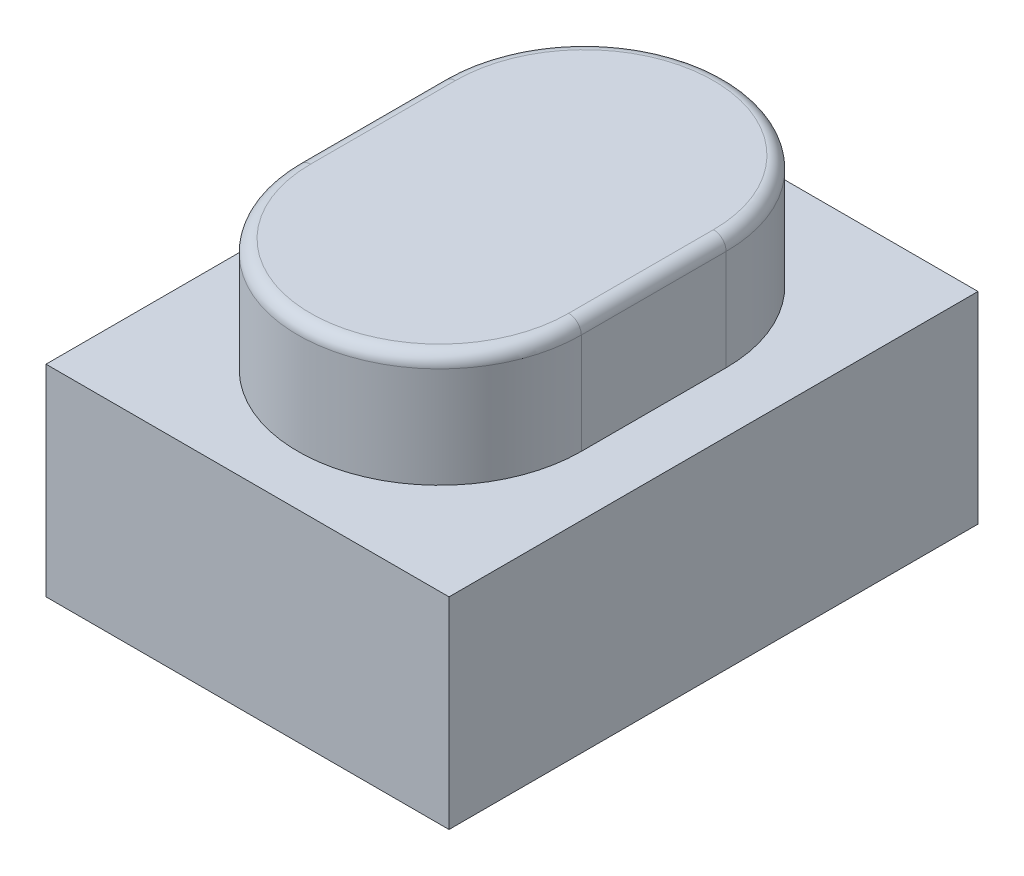
ISO-10303-21;
HEADER;
FILE_DESCRIPTION(('STEP AP214'),'2;1');
FILE_NAME('part.step','',(''),(''),'','','');
FILE_SCHEMA(('AUTOMOTIVE_DESIGN { 1 0 10303 214 1 1 1 1 }'));
ENDSEC;
DATA;
#1=APPLICATION_CONTEXT('core data for automotive mechanical design processes');
#2=APPLICATION_PROTOCOL_DEFINITION('international standard','automotive_design',2000,#1);
#3=PRODUCT_CONTEXT('',#1,'mechanical');
#4=PRODUCT('Part','Part','',(#3));
#5=PRODUCT_RELATED_PRODUCT_CATEGORY('part','',(#4));
#6=PRODUCT_DEFINITION_FORMATION('','',#4);
#7=PRODUCT_DEFINITION_CONTEXT('part definition',#1,'design');
#8=PRODUCT_DEFINITION('design','',#6,#7);
#9=PRODUCT_DEFINITION_SHAPE('','',#8);
#10=(LENGTH_UNIT() NAMED_UNIT(*) SI_UNIT(.MILLI.,.METRE.));
#11=(NAMED_UNIT(*) PLANE_ANGLE_UNIT() SI_UNIT($,.RADIAN.));
#12=(NAMED_UNIT(*) SI_UNIT($,.STERADIAN.) SOLID_ANGLE_UNIT());
#13=UNCERTAINTY_MEASURE_WITH_UNIT(LENGTH_MEASURE(1.E-05),#10,'distance_accuracy_value','');
#14=(GEOMETRIC_REPRESENTATION_CONTEXT(3) GLOBAL_UNCERTAINTY_ASSIGNED_CONTEXT((#13)) GLOBAL_UNIT_ASSIGNED_CONTEXT((#10,
#11,#12)) REPRESENTATION_CONTEXT('',''));
#15=CARTESIAN_POINT('',(0.,0.,0.));
#16=DIRECTION('',(0.,0.,1.));
#17=DIRECTION('',(1.,0.,0.));
#18=AXIS2_PLACEMENT_3D('',#15,#16,#17);
#19=CARTESIAN_POINT('',(1.6,1.6,-2.1));
#20=DIRECTION('',(-1.,0.,0.));
#21=DIRECTION('',(0.,0.,1.));
#22=AXIS2_PLACEMENT_3D('',#19,#20,#21);
#23=PLANE('',#22);
#24=DIRECTION('',(0.,0.,-1.));
#25=VECTOR('',#24,1.);
#26=CARTESIAN_POINT('',(1.6,0.,-2.1));
#27=LINE('',#26,#25);
#28=CARTESIAN_POINT('',(1.6,0.,2.1));
#29=VERTEX_POINT('',#28);
#30=CARTESIAN_POINT('',(1.6,0.,-2.1));
#31=VERTEX_POINT('',#30);
#32=EDGE_CURVE('E140',#29,#31,#27,.T.);
#33=ORIENTED_EDGE('',*,*,#32,.T.);
#34=DIRECTION('',(0.,-1.,0.));
#35=VECTOR('',#34,1.);
#36=CARTESIAN_POINT('',(1.6,1.6,-2.1));
#37=LINE('',#36,#35);
#38=CARTESIAN_POINT('',(1.6,1.6,-2.1));
#39=VERTEX_POINT('',#38);
#40=EDGE_CURVE('E167',#39,#31,#37,.T.);
#41=ORIENTED_EDGE('',*,*,#40,.F.);
#42=DIRECTION('',(0.,0.,-1.));
#43=VECTOR('',#42,1.);
#44=CARTESIAN_POINT('',(1.6,1.6,-2.1));
#45=LINE('',#44,#43);
#46=CARTESIAN_POINT('',(1.6,1.6,2.1));
#47=VERTEX_POINT('',#46);
#48=EDGE_CURVE('E141',#47,#39,#45,.T.);
#49=ORIENTED_EDGE('',*,*,#48,.F.);
#50=DIRECTION('',(0.,-1.,0.));
#51=VECTOR('',#50,1.);
#52=CARTESIAN_POINT('',(1.6,1.6,2.1));
#53=LINE('',#52,#51);
#54=EDGE_CURVE('E151',#47,#29,#53,.T.);
#55=ORIENTED_EDGE('',*,*,#54,.T.);
#56=EDGE_LOOP('',(#33,#41,#49,#55));
#57=FACE_BOUND('',#56,.T.);
#58=ADVANCED_FACE('F35',(#57),#23,.F.);
#59=CARTESIAN_POINT('',(-1.6,1.6,-2.1));
#60=DIRECTION('',(0.,0.,1.));
#61=DIRECTION('',(1.,0.,0.));
#62=AXIS2_PLACEMENT_3D('',#59,#60,#61);
#63=PLANE('',#62);
#64=DIRECTION('',(-1.,0.,0.));
#65=VECTOR('',#64,1.);
#66=CARTESIAN_POINT('',(-1.6,0.,-2.1));
#67=LINE('',#66,#65);
#68=CARTESIAN_POINT('',(-1.6,0.,-2.1));
#69=VERTEX_POINT('',#68);
#70=EDGE_CURVE('E154',#31,#69,#67,.T.);
#71=ORIENTED_EDGE('',*,*,#70,.T.);
#72=DIRECTION('',(0.,-1.,0.));
#73=VECTOR('',#72,1.);
#74=CARTESIAN_POINT('',(-1.6,1.6,-2.1));
#75=LINE('',#74,#73);
#76=CARTESIAN_POINT('',(-1.6,1.6,-2.1));
#77=VERTEX_POINT('',#76);
#78=EDGE_CURVE('E164',#77,#69,#75,.T.);
#79=ORIENTED_EDGE('',*,*,#78,.F.);
#80=DIRECTION('',(-1.,0.,0.));
#81=VECTOR('',#80,1.);
#82=CARTESIAN_POINT('',(-1.6,1.6,-2.1));
#83=LINE('',#82,#81);
#84=EDGE_CURVE('E144',#39,#77,#83,.T.);
#85=ORIENTED_EDGE('',*,*,#84,.F.);
#86=ORIENTED_EDGE('',*,*,#40,.T.);
#87=EDGE_LOOP('',(#71,#79,#85,#86));
#88=FACE_BOUND('',#87,.T.);
#89=ADVANCED_FACE('F222',(#88),#63,.F.);
#90=CARTESIAN_POINT('',(-1.6,1.6,-2.1));
#91=DIRECTION('',(1.,0.,0.));
#92=DIRECTION('',(0.,0.,-1.));
#93=AXIS2_PLACEMENT_3D('',#90,#91,#92);
#94=PLANE('',#93);
#95=DIRECTION('',(0.,0.,1.));
#96=VECTOR('',#95,1.);
#97=CARTESIAN_POINT('',(-1.6,0.,-2.1));
#98=LINE('',#97,#96);
#99=CARTESIAN_POINT('',(-1.6,0.,2.1));
#100=VERTEX_POINT('',#99);
#101=EDGE_CURVE('E156',#69,#100,#98,.T.);
#102=ORIENTED_EDGE('',*,*,#101,.T.);
#103=DIRECTION('',(0.,-1.,0.));
#104=VECTOR('',#103,1.);
#105=CARTESIAN_POINT('',(-1.6,1.6,2.1));
#106=LINE('',#105,#104);
#107=CARTESIAN_POINT('',(-1.6,1.6,2.1));
#108=VERTEX_POINT('',#107);
#109=EDGE_CURVE('E161',#108,#100,#106,.T.);
#110=ORIENTED_EDGE('',*,*,#109,.F.);
#111=DIRECTION('',(0.,0.,1.));
#112=VECTOR('',#111,1.);
#113=CARTESIAN_POINT('',(-1.6,1.6,-2.1));
#114=LINE('',#113,#112);
#115=EDGE_CURVE('E147',#77,#108,#114,.T.);
#116=ORIENTED_EDGE('',*,*,#115,.F.);
#117=ORIENTED_EDGE('',*,*,#78,.T.);
#118=EDGE_LOOP('',(#102,#110,#116,#117));
#119=FACE_BOUND('',#118,.T.);
#120=ADVANCED_FACE('F228',(#119),#94,.F.);
#121=CARTESIAN_POINT('',(-1.6,1.6,2.1));
#122=DIRECTION('',(0.,0.,-1.));
#123=DIRECTION('',(-1.,0.,0.));
#124=AXIS2_PLACEMENT_3D('',#121,#122,#123);
#125=PLANE('',#124);
#126=DIRECTION('',(1.,0.,0.));
#127=VECTOR('',#126,1.);
#128=CARTESIAN_POINT('',(-1.6,0.,2.1));
#129=LINE('',#128,#127);
#130=EDGE_CURVE('E145',#100,#29,#129,.T.);
#131=ORIENTED_EDGE('',*,*,#130,.T.);
#132=ORIENTED_EDGE('',*,*,#54,.F.);
#133=DIRECTION('',(1.,0.,0.));
#134=VECTOR('',#133,1.);
#135=CARTESIAN_POINT('',(-1.6,1.6,2.1));
#136=LINE('',#135,#134);
#137=EDGE_CURVE('E149',#108,#47,#136,.T.);
#138=ORIENTED_EDGE('',*,*,#137,.F.);
#139=ORIENTED_EDGE('',*,*,#109,.T.);
#140=EDGE_LOOP('',(#131,#132,#138,#139));
#141=FACE_BOUND('',#140,.T.);
#142=ADVANCED_FACE('F307',(#141),#125,.F.);
#143=CARTESIAN_POINT('',(0.,1.6,0.));
#144=DIRECTION('',(0.,1.,0.));
#145=DIRECTION('',(0.,0.,1.));
#146=AXIS2_PLACEMENT_3D('',#143,#144,#145);
#147=PLANE('',#146);
#148=CARTESIAN_POINT('',(0.,1.6,-0.575));
#149=DIRECTION('',(0.,1.,0.));
#150=DIRECTION('',(0.,0.,1.));
#151=AXIS2_PLACEMENT_3D('',#148,#149,#150);
#152=CIRCLE('',#151,1.125);
#153=CARTESIAN_POINT('',(1.125,1.6,-0.575000000000001));
#154=VERTEX_POINT('',#153);
#155=CARTESIAN_POINT('',(-1.125,1.6,-0.575));
#156=VERTEX_POINT('',#155);
#157=EDGE_CURVE('E131',#154,#156,#152,.T.);
#158=ORIENTED_EDGE('',*,*,#157,.F.);
#159=DIRECTION('',(0.,0.,-1.));
#160=VECTOR('',#159,1.);
#161=CARTESIAN_POINT('',(1.125,1.6,-0.575000000000001));
#162=LINE('',#161,#160);
#163=CARTESIAN_POINT('',(1.125,1.6,0.575));
#164=VERTEX_POINT('',#163);
#165=EDGE_CURVE('E128',#164,#154,#162,.T.);
#166=ORIENTED_EDGE('',*,*,#165,.F.);
#167=CARTESIAN_POINT('',(0.,1.6,0.575));
#168=DIRECTION('',(0.,1.,0.));
#169=DIRECTION('',(0.,0.,1.));
#170=AXIS2_PLACEMENT_3D('',#167,#168,#169);
#171=CIRCLE('',#170,1.125);
#172=CARTESIAN_POINT('',(-1.125,1.6,0.575));
#173=VERTEX_POINT('',#172);
#174=EDGE_CURVE('E114',#173,#164,#171,.T.);
#175=ORIENTED_EDGE('',*,*,#174,.F.);
#176=DIRECTION('',(0.,0.,1.));
#177=VECTOR('',#176,1.);
#178=CARTESIAN_POINT('',(-1.125,1.6,-0.575));
#179=LINE('',#178,#177);
#180=EDGE_CURVE('E125',#156,#173,#179,.T.);
#181=ORIENTED_EDGE('',*,*,#180,.F.);
#182=EDGE_LOOP('',(#158,#166,#175,#181));
#183=FACE_BOUND('',#182,.T.);
#184=ORIENTED_EDGE('',*,*,#48,.T.);
#185=ORIENTED_EDGE('',*,*,#84,.T.);
#186=ORIENTED_EDGE('',*,*,#115,.T.);
#187=ORIENTED_EDGE('',*,*,#137,.T.);
#188=EDGE_LOOP('',(#184,#185,#186,#187));
#189=FACE_BOUND('',#188,.T.);
#190=ADVANCED_FACE('F123',(#183,#189),#147,.T.);
#191=CARTESIAN_POINT('',(0.,0.,0.));
#192=DIRECTION('',(0.,1.,0.));
#193=DIRECTION('',(0.,0.,1.));
#194=AXIS2_PLACEMENT_3D('',#191,#192,#193);
#195=PLANE('',#194);
#196=ORIENTED_EDGE('',*,*,#32,.F.);
#197=ORIENTED_EDGE('',*,*,#130,.F.);
#198=ORIENTED_EDGE('',*,*,#101,.F.);
#199=ORIENTED_EDGE('',*,*,#70,.F.);
#200=EDGE_LOOP('',(#196,#197,#198,#199));
#201=FACE_BOUND('',#200,.T.);
#202=ADVANCED_FACE('F290',(#201),#195,.F.);
#203=CARTESIAN_POINT('',(0.,2.5,-0.575));
#204=DIRECTION('',(0.,-1.,0.));
#205=DIRECTION('',(0.,0.,-1.));
#206=AXIS2_PLACEMENT_3D('',#203,#204,#205);
#207=CYLINDRICAL_SURFACE('',#206,1.125);
#208=DIRECTION('',(0.,-1.,0.));
#209=VECTOR('',#208,1.);
#210=CARTESIAN_POINT('',(-1.125,2.5,-0.575));
#211=LINE('',#210,#209);
#212=CARTESIAN_POINT('',(-1.125,2.4,-0.575));
#213=VERTEX_POINT('',#212);
#214=EDGE_CURVE('E116',#213,#156,#211,.T.);
#215=ORIENTED_EDGE('',*,*,#214,.F.);
#216=CARTESIAN_POINT('',(0.,2.4,-0.575));
#217=DIRECTION('',(0.,1.,0.));
#218=DIRECTION('',(0.,0.,1.));
#219=AXIS2_PLACEMENT_3D('',#216,#217,#218);
#220=CIRCLE('',#219,1.125);
#221=CARTESIAN_POINT('',(1.125,2.4,-0.575000000000001));
#222=VERTEX_POINT('',#221);
#223=EDGE_CURVE('E11',#213,#222,#220,.F.);
#224=ORIENTED_EDGE('',*,*,#223,.T.);
#225=DIRECTION('',(0.,-1.,0.));
#226=VECTOR('',#225,1.);
#227=CARTESIAN_POINT('',(1.125,2.5,-0.575000000000001));
#228=LINE('',#227,#226);
#229=EDGE_CURVE('E136',#222,#154,#228,.T.);
#230=ORIENTED_EDGE('',*,*,#229,.T.);
#231=ORIENTED_EDGE('',*,*,#157,.T.);
#232=EDGE_LOOP('',(#215,#224,#230,#231));
#233=FACE_BOUND('',#232,.T.);
#234=ADVANCED_FACE('F205',(#233),#207,.T.);
#235=CARTESIAN_POINT('',(-1.125,2.5,-0.575));
#236=DIRECTION('',(1.,0.,0.));
#237=DIRECTION('',(0.,0.,-1.));
#238=AXIS2_PLACEMENT_3D('',#235,#236,#237);
#239=PLANE('',#238);
#240=DIRECTION('',(0.,-1.,0.));
#241=VECTOR('',#240,1.);
#242=CARTESIAN_POINT('',(-1.125,2.5,0.575));
#243=LINE('',#242,#241);
#244=CARTESIAN_POINT('',(-1.125,2.4,0.575));
#245=VERTEX_POINT('',#244);
#246=EDGE_CURVE('E111',#245,#173,#243,.T.);
#247=ORIENTED_EDGE('',*,*,#246,.F.);
#248=DIRECTION('',(0.,0.,1.));
#249=VECTOR('',#248,1.);
#250=CARTESIAN_POINT('',(-1.125,2.4,-0.575));
#251=LINE('',#250,#249);
#252=EDGE_CURVE('E44',#245,#213,#251,.F.);
#253=ORIENTED_EDGE('',*,*,#252,.T.);
#254=ORIENTED_EDGE('',*,*,#214,.T.);
#255=ORIENTED_EDGE('',*,*,#180,.T.);
#256=EDGE_LOOP('',(#247,#253,#254,#255));
#257=FACE_BOUND('',#256,.T.);
#258=ADVANCED_FACE('F130',(#257),#239,.F.);
#259=CARTESIAN_POINT('',(0.,2.5,0.575));
#260=DIRECTION('',(0.,-1.,0.));
#261=DIRECTION('',(0.,0.,-1.));
#262=AXIS2_PLACEMENT_3D('',#259,#260,#261);
#263=CYLINDRICAL_SURFACE('',#262,1.125);
#264=DIRECTION('',(0.,-1.,0.));
#265=VECTOR('',#264,1.);
#266=CARTESIAN_POINT('',(1.125,2.5,0.575));
#267=LINE('',#266,#265);
#268=CARTESIAN_POINT('',(1.125,2.4,0.575));
#269=VERTEX_POINT('',#268);
#270=EDGE_CURVE('E117',#269,#164,#267,.T.);
#271=ORIENTED_EDGE('',*,*,#270,.F.);
#272=CARTESIAN_POINT('',(0.,2.4,0.575));
#273=DIRECTION('',(0.,1.,0.));
#274=DIRECTION('',(0.,0.,1.));
#275=AXIS2_PLACEMENT_3D('',#272,#273,#274);
#276=CIRCLE('',#275,1.125);
#277=EDGE_CURVE('E59',#269,#245,#276,.F.);
#278=ORIENTED_EDGE('',*,*,#277,.T.);
#279=ORIENTED_EDGE('',*,*,#246,.T.);
#280=ORIENTED_EDGE('',*,*,#174,.T.);
#281=EDGE_LOOP('',(#271,#278,#279,#280));
#282=FACE_BOUND('',#281,.T.);
#283=ADVANCED_FACE('F113',(#282),#263,.T.);
#284=CARTESIAN_POINT('',(1.125,2.5,-0.575000000000001));
#285=DIRECTION('',(-1.,0.,0.));
#286=DIRECTION('',(0.,0.,1.));
#287=AXIS2_PLACEMENT_3D('',#284,#285,#286);
#288=PLANE('',#287);
#289=ORIENTED_EDGE('',*,*,#229,.F.);
#290=DIRECTION('',(0.,0.,-1.));
#291=VECTOR('',#290,1.);
#292=CARTESIAN_POINT('',(1.125,2.4,0.575));
#293=LINE('',#292,#291);
#294=EDGE_CURVE('E179',#222,#269,#293,.F.);
#295=ORIENTED_EDGE('',*,*,#294,.T.);
#296=ORIENTED_EDGE('',*,*,#270,.T.);
#297=ORIENTED_EDGE('',*,*,#165,.T.);
#298=EDGE_LOOP('',(#289,#295,#296,#297));
#299=FACE_BOUND('',#298,.T.);
#300=ADVANCED_FACE('F208',(#299),#288,.F.);
#301=CARTESIAN_POINT('',(0.,2.5,-0.575));
#302=DIRECTION('',(0.,1.,0.));
#303=DIRECTION('',(0.,0.,1.));
#304=AXIS2_PLACEMENT_3D('',#301,#302,#303);
#305=PLANE('',#304);
#306=CARTESIAN_POINT('',(0.,2.5,0.575));
#307=DIRECTION('',(0.,1.,0.));
#308=DIRECTION('',(0.,0.,1.));
#309=AXIS2_PLACEMENT_3D('',#306,#307,#308);
#310=CIRCLE('',#309,1.025);
#311=CARTESIAN_POINT('',(-1.025,2.5,0.575));
#312=VERTEX_POINT('',#311);
#313=CARTESIAN_POINT('',(1.025,2.5,0.575));
#314=VERTEX_POINT('',#313);
#315=EDGE_CURVE('E174',#312,#314,#310,.T.);
#316=ORIENTED_EDGE('',*,*,#315,.T.);
#317=DIRECTION('',(0.,0.,-1.));
#318=VECTOR('',#317,1.);
#319=CARTESIAN_POINT('',(1.025,2.5,-0.575000000000001));
#320=LINE('',#319,#318);
#321=CARTESIAN_POINT('',(1.025,2.5,-0.575000000000001));
#322=VERTEX_POINT('',#321);
#323=EDGE_CURVE('E176',#314,#322,#320,.T.);
#324=ORIENTED_EDGE('',*,*,#323,.T.);
#325=CARTESIAN_POINT('',(0.,2.5,-0.575));
#326=DIRECTION('',(0.,1.,0.));
#327=DIRECTION('',(0.,0.,1.));
#328=AXIS2_PLACEMENT_3D('',#325,#326,#327);
#329=CIRCLE('',#328,1.025);
#330=CARTESIAN_POINT('',(-1.025,2.5,-0.575));
#331=VERTEX_POINT('',#330);
#332=EDGE_CURVE('E170',#322,#331,#329,.T.);
#333=ORIENTED_EDGE('',*,*,#332,.T.);
#334=DIRECTION('',(0.,0.,1.));
#335=VECTOR('',#334,1.);
#336=CARTESIAN_POINT('',(-1.025,2.5,0.575));
#337=LINE('',#336,#335);
#338=EDGE_CURVE('E172',#331,#312,#337,.T.);
#339=ORIENTED_EDGE('',*,*,#338,.T.);
#340=EDGE_LOOP('',(#316,#324,#333,#339));
#341=FACE_BOUND('',#340,.T.);
#342=ADVANCED_FACE('F213',(#341),#305,.T.);
#343=CARTESIAN_POINT('',(-1.025,2.4,-0.575));
#344=DIRECTION('',(0.,0.,-1.));
#345=DIRECTION('',(-1.,0.,0.));
#346=AXIS2_PLACEMENT_3D('',#343,#344,#345);
#347=CYLINDRICAL_SURFACE('',#346,0.1);
#348=CARTESIAN_POINT('',(-1.025,2.4,-0.575));
#349=DIRECTION('',(0.,0.,-1.));
#350=DIRECTION('',(-1.,0.,0.));
#351=AXIS2_PLACEMENT_3D('',#348,#349,#350);
#352=CIRCLE('',#351,0.1);
#353=EDGE_CURVE('E187',#213,#331,#352,.T.);
#354=ORIENTED_EDGE('',*,*,#353,.F.);
#355=ORIENTED_EDGE('',*,*,#252,.F.);
#356=CARTESIAN_POINT('',(-1.025,2.4,0.575));
#357=DIRECTION('',(0.,0.,1.));
#358=DIRECTION('',(1.,0.,0.));
#359=AXIS2_PLACEMENT_3D('',#356,#357,#358);
#360=CIRCLE('',#359,0.1);
#361=EDGE_CURVE('E39',#312,#245,#360,.T.);
#362=ORIENTED_EDGE('',*,*,#361,.F.);
#363=ORIENTED_EDGE('',*,*,#338,.F.);
#364=EDGE_LOOP('',(#354,#355,#362,#363));
#365=FACE_BOUND('',#364,.T.);
#366=ADVANCED_FACE('F37',(#365),#347,.T.);
#367=CARTESIAN_POINT('',(0.,2.4,0.575));
#368=DIRECTION('',(0.,1.,0.));
#369=DIRECTION('',(0.,0.,1.));
#370=AXIS2_PLACEMENT_3D('',#367,#368,#369);
#371=TOROIDAL_SURFACE('',#370,1.025,0.1);
#372=ORIENTED_EDGE('',*,*,#361,.T.);
#373=ORIENTED_EDGE('',*,*,#277,.F.);
#374=CARTESIAN_POINT('',(1.025,2.4,0.575));
#375=DIRECTION('',(0.,0.,-1.));
#376=DIRECTION('',(-1.,0.,0.));
#377=AXIS2_PLACEMENT_3D('',#374,#375,#376);
#378=CIRCLE('',#377,0.1);
#379=EDGE_CURVE('E186',#314,#269,#378,.T.);
#380=ORIENTED_EDGE('',*,*,#379,.F.);
#381=ORIENTED_EDGE('',*,*,#315,.F.);
#382=EDGE_LOOP('',(#372,#373,#380,#381));
#383=FACE_BOUND('',#382,.T.);
#384=ADVANCED_FACE('F197',(#383),#371,.T.);
#385=CARTESIAN_POINT('',(0.,2.4,-0.575));
#386=DIRECTION('',(0.,1.,0.));
#387=DIRECTION('',(0.,0.,1.));
#388=AXIS2_PLACEMENT_3D('',#385,#386,#387);
#389=TOROIDAL_SURFACE('',#388,1.025,0.1);
#390=ORIENTED_EDGE('',*,*,#353,.T.);
#391=ORIENTED_EDGE('',*,*,#332,.F.);
#392=CARTESIAN_POINT('',(1.025,2.4,-0.575000000000001));
#393=DIRECTION('',(0.,0.,1.));
#394=DIRECTION('',(1.,0.,0.));
#395=AXIS2_PLACEMENT_3D('',#392,#393,#394);
#396=CIRCLE('',#395,0.1);
#397=EDGE_CURVE('E184',#222,#322,#396,.T.);
#398=ORIENTED_EDGE('',*,*,#397,.F.);
#399=ORIENTED_EDGE('',*,*,#223,.F.);
#400=EDGE_LOOP('',(#390,#391,#398,#399));
#401=FACE_BOUND('',#400,.T.);
#402=ADVANCED_FACE('F202',(#401),#389,.T.);
#403=CARTESIAN_POINT('',(1.025,2.4,-0.575));
#404=DIRECTION('',(0.,0.,1.));
#405=DIRECTION('',(1.,0.,0.));
#406=AXIS2_PLACEMENT_3D('',#403,#404,#405);
#407=CYLINDRICAL_SURFACE('',#406,0.1);
#408=ORIENTED_EDGE('',*,*,#379,.T.);
#409=ORIENTED_EDGE('',*,*,#294,.F.);
#410=ORIENTED_EDGE('',*,*,#397,.T.);
#411=ORIENTED_EDGE('',*,*,#323,.F.);
#412=EDGE_LOOP('',(#408,#409,#410,#411));
#413=FACE_BOUND('',#412,.T.);
#414=ADVANCED_FACE('F210',(#413),#407,.T.);
#415=CLOSED_SHELL('',(#58,#89,#120,#142,#190,#202,#234,#258,#283,#300,#342,#366,#384,#402,#414));
#416=MANIFOLD_SOLID_BREP('B2',#415);
#417=ADVANCED_BREP_SHAPE_REPRESENTATION('',(#18,#416),#14);
#418=SHAPE_DEFINITION_REPRESENTATION(#9,#417);
ENDSEC;
END-ISO-10303-21;
